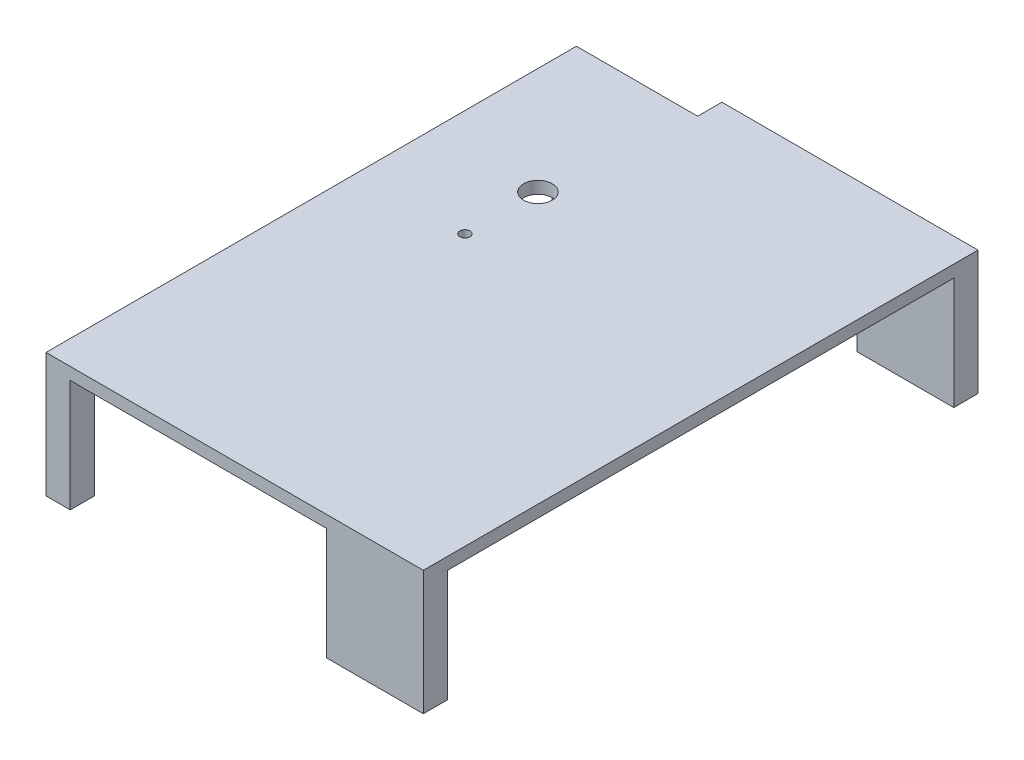
ISO-10303-21;
HEADER;
FILE_DESCRIPTION(('STEP AP214'),'2;1');
FILE_NAME('part.step','',(''),(''),'','','');
FILE_SCHEMA(('AUTOMOTIVE_DESIGN { 1 0 10303 214 1 1 1 1 }'));
ENDSEC;
DATA;
#1=APPLICATION_CONTEXT('core data for automotive mechanical design processes');
#2=APPLICATION_PROTOCOL_DEFINITION('international standard','automotive_design',2000,#1);
#3=PRODUCT_CONTEXT('',#1,'mechanical');
#4=PRODUCT('Part','Part','',(#3));
#5=PRODUCT_RELATED_PRODUCT_CATEGORY('part','',(#4));
#6=PRODUCT_DEFINITION_FORMATION('','',#4);
#7=PRODUCT_DEFINITION_CONTEXT('part definition',#1,'design');
#8=PRODUCT_DEFINITION('design','',#6,#7);
#9=PRODUCT_DEFINITION_SHAPE('','',#8);
#10=(LENGTH_UNIT() NAMED_UNIT(*) SI_UNIT(.MILLI.,.METRE.));
#11=(NAMED_UNIT(*) PLANE_ANGLE_UNIT() SI_UNIT($,.RADIAN.));
#12=(NAMED_UNIT(*) SI_UNIT($,.STERADIAN.) SOLID_ANGLE_UNIT());
#13=UNCERTAINTY_MEASURE_WITH_UNIT(LENGTH_MEASURE(1.E-05),#10,'distance_accuracy_value','');
#14=(GEOMETRIC_REPRESENTATION_CONTEXT(3) GLOBAL_UNCERTAINTY_ASSIGNED_CONTEXT((#13)) GLOBAL_UNIT_ASSIGNED_CONTEXT((#10,
#11,#12)) REPRESENTATION_CONTEXT('',''));
#15=CARTESIAN_POINT('',(0.,0.,0.));
#16=DIRECTION('',(0.,0.,1.));
#17=DIRECTION('',(1.,0.,0.));
#18=AXIS2_PLACEMENT_3D('',#15,#16,#17);
#19=CARTESIAN_POINT('',(12.7,0.,0.));
#20=DIRECTION('',(1.,0.,0.));
#21=DIRECTION('',(0.,0.,-1.));
#22=AXIS2_PLACEMENT_3D('',#19,#20,#21);
#23=PLANE('',#22);
#24=DIRECTION('',(0.,0.,-1.));
#25=VECTOR('',#24,1.);
#26=CARTESIAN_POINT('',(12.7,-58.7375,0.));
#27=LINE('',#26,#25);
#28=CARTESIAN_POINT('',(12.7,-58.7375,145.25625));
#29=VERTEX_POINT('',#28);
#30=CARTESIAN_POINT('',(12.7,-58.7375,132.55625));
#31=VERTEX_POINT('',#30);
#32=EDGE_CURVE('E301',#29,#31,#27,.T.);
#33=ORIENTED_EDGE('',*,*,#32,.F.);
#34=DIRECTION('',(0.,-1.,0.));
#35=VECTOR('',#34,1.);
#36=CARTESIAN_POINT('',(12.7,6.35,145.25625));
#37=LINE('',#36,#35);
#38=CARTESIAN_POINT('',(12.7,6.35,145.25625));
#39=VERTEX_POINT('',#38);
#40=EDGE_CURVE('E41',#39,#29,#37,.T.);
#41=ORIENTED_EDGE('',*,*,#40,.F.);
#42=DIRECTION('',(0.,0.,1.));
#43=VECTOR('',#42,1.);
#44=CARTESIAN_POINT('',(12.7,6.35,0.));
#45=LINE('',#44,#43);
#46=CARTESIAN_POINT('',(12.7,6.35,-132.55625));
#47=VERTEX_POINT('',#46);
#48=EDGE_CURVE('E49',#47,#39,#45,.T.);
#49=ORIENTED_EDGE('',*,*,#48,.F.);
#50=DIRECTION('',(0.,1.,0.));
#51=VECTOR('',#50,1.);
#52=CARTESIAN_POINT('',(12.7,-10.16,-132.55625));
#53=LINE('',#52,#51);
#54=CARTESIAN_POINT('',(12.7,-58.7375,-132.55625));
#55=VERTEX_POINT('',#54);
#56=EDGE_CURVE('E57',#55,#47,#53,.T.);
#57=ORIENTED_EDGE('',*,*,#56,.F.);
#58=DIRECTION('',(0.,0.,-1.));
#59=VECTOR('',#58,1.);
#60=CARTESIAN_POINT('',(12.7,-58.7375,0.));
#61=LINE('',#60,#59);
#62=CARTESIAN_POINT('',(12.7,-58.7375,-119.85625));
#63=VERTEX_POINT('',#62);
#64=EDGE_CURVE('E166',#63,#55,#61,.T.);
#65=ORIENTED_EDGE('',*,*,#64,.F.);
#66=DIRECTION('',(0.,-1.,0.));
#67=VECTOR('',#66,1.);
#68=CARTESIAN_POINT('',(12.7,-58.7375,-119.85625));
#69=LINE('',#68,#67);
#70=CARTESIAN_POINT('',(12.7,0.,-119.85625));
#71=VERTEX_POINT('',#70);
#72=EDGE_CURVE('E299',#71,#63,#69,.T.);
#73=ORIENTED_EDGE('',*,*,#72,.F.);
#74=DIRECTION('',(0.,0.,1.));
#75=VECTOR('',#74,1.);
#76=CARTESIAN_POINT('',(12.7,0.,0.));
#77=LINE('',#76,#75);
#78=CARTESIAN_POINT('',(12.7,0.,132.55625));
#79=VERTEX_POINT('',#78);
#80=EDGE_CURVE('E11',#71,#79,#77,.T.);
#81=ORIENTED_EDGE('',*,*,#80,.T.);
#82=DIRECTION('',(0.,1.,0.));
#83=VECTOR('',#82,1.);
#84=CARTESIAN_POINT('',(12.7,-58.7375,132.55625));
#85=LINE('',#84,#83);
#86=EDGE_CURVE('E36',#31,#79,#85,.T.);
#87=ORIENTED_EDGE('',*,*,#86,.F.);
#88=EDGE_LOOP('',(#33,#41,#49,#57,#65,#73,#81,#87));
#89=FACE_BOUND('',#88,.T.);
#90=ADVANCED_FACE('F33',(#89),#23,.F.);
#91=CARTESIAN_POINT('',(0.,-58.7375,0.));
#92=DIRECTION('',(0.,-1.,0.));
#93=DIRECTION('',(0.,0.,-1.));
#94=AXIS2_PLACEMENT_3D('',#91,#92,#93);
#95=PLANE('',#94);
#96=DIRECTION('',(0.,0.,1.));
#97=VECTOR('',#96,1.);
#98=CARTESIAN_POINT('',(210.34375,-58.7375,-145.25625));
#99=LINE('',#98,#97);
#100=CARTESIAN_POINT('',(210.34375,-58.7375,-145.25625));
#101=VERTEX_POINT('',#100);
#102=CARTESIAN_POINT('',(210.34375,-58.7375,-132.55625));
#103=VERTEX_POINT('',#102);
#104=EDGE_CURVE('E213',#101,#103,#99,.T.);
#105=ORIENTED_EDGE('',*,*,#104,.T.);
#106=DIRECTION('',(-1.,0.,0.));
#107=VECTOR('',#106,1.);
#108=CARTESIAN_POINT('',(210.34375,-58.7375,-132.55625));
#109=LINE('',#108,#107);
#110=CARTESIAN_POINT('',(159.54375,-58.7375,-132.55625));
#111=VERTEX_POINT('',#110);
#112=EDGE_CURVE('E216',#103,#111,#109,.T.);
#113=ORIENTED_EDGE('',*,*,#112,.T.);
#114=DIRECTION('',(0.,0.,-1.));
#115=VECTOR('',#114,1.);
#116=CARTESIAN_POINT('',(159.54375,-58.7375,-145.25625));
#117=LINE('',#116,#115);
#118=CARTESIAN_POINT('',(159.54375,-58.7375,-145.25625));
#119=VERTEX_POINT('',#118);
#120=EDGE_CURVE('E219',#111,#119,#117,.T.);
#121=ORIENTED_EDGE('',*,*,#120,.T.);
#122=DIRECTION('',(1.,0.,0.));
#123=VECTOR('',#122,1.);
#124=CARTESIAN_POINT('',(210.34375,-58.7375,-145.25625));
#125=LINE('',#124,#123);
#126=EDGE_CURVE('E221',#119,#101,#125,.T.);
#127=ORIENTED_EDGE('',*,*,#126,.T.);
#128=EDGE_LOOP('',(#105,#113,#121,#127));
#129=FACE_BOUND('',#128,.T.);
#130=ADVANCED_FACE('F349',(#129),#95,.T.);
#131=CARTESIAN_POINT('',(210.34375,-58.7375,132.55625));
#132=DIRECTION('',(0.,0.,1.));
#133=DIRECTION('',(1.,0.,0.));
#134=AXIS2_PLACEMENT_3D('',#131,#132,#133);
#135=PLANE('',#134);
#136=DIRECTION('',(1.,0.,0.));
#137=VECTOR('',#136,1.);
#138=CARTESIAN_POINT('',(210.34375,0.,132.55625));
#139=LINE('',#138,#137);
#140=CARTESIAN_POINT('',(159.54375,0.,132.55625));
#141=VERTEX_POINT('',#140);
#142=CARTESIAN_POINT('',(210.34375,0.,132.55625));
#143=VERTEX_POINT('',#142);
#144=EDGE_CURVE('E196',#141,#143,#139,.T.);
#145=ORIENTED_EDGE('',*,*,#144,.T.);
#146=DIRECTION('',(0.,1.,0.));
#147=VECTOR('',#146,1.);
#148=CARTESIAN_POINT('',(210.34375,-58.7375,132.55625));
#149=LINE('',#148,#147);
#150=CARTESIAN_POINT('',(210.34375,-58.7375,132.55625));
#151=VERTEX_POINT('',#150);
#152=EDGE_CURVE('E202',#151,#143,#149,.T.);
#153=ORIENTED_EDGE('',*,*,#152,.F.);
#154=DIRECTION('',(1.,0.,0.));
#155=VECTOR('',#154,1.);
#156=CARTESIAN_POINT('',(210.34375,-58.7375,132.55625));
#157=LINE('',#156,#155);
#158=CARTESIAN_POINT('',(159.54375,-58.7375,132.55625));
#159=VERTEX_POINT('',#158);
#160=EDGE_CURVE('E200',#159,#151,#157,.T.);
#161=ORIENTED_EDGE('',*,*,#160,.F.);
#162=DIRECTION('',(0.,1.,0.));
#163=VECTOR('',#162,1.);
#164=CARTESIAN_POINT('',(159.54375,-58.7375,132.55625));
#165=LINE('',#164,#163);
#166=EDGE_CURVE('E207',#159,#141,#165,.T.);
#167=ORIENTED_EDGE('',*,*,#166,.T.);
#168=EDGE_LOOP('',(#145,#153,#161,#167));
#169=FACE_BOUND('',#168,.T.);
#170=ADVANCED_FACE('F353',(#169),#135,.F.);
#171=CARTESIAN_POINT('',(210.34375,-58.7375,-132.55625));
#172=DIRECTION('',(0.,0.,-1.));
#173=DIRECTION('',(-1.,0.,0.));
#174=AXIS2_PLACEMENT_3D('',#171,#172,#173);
#175=PLANE('',#174);
#176=DIRECTION('',(-1.,0.,0.));
#177=VECTOR('',#176,1.);
#178=CARTESIAN_POINT('',(210.34375,0.,-132.55625));
#179=LINE('',#178,#177);
#180=CARTESIAN_POINT('',(210.34375,0.,-132.55625));
#181=VERTEX_POINT('',#180);
#182=CARTESIAN_POINT('',(159.54375,0.,-132.55625));
#183=VERTEX_POINT('',#182);
#184=EDGE_CURVE('E212',#181,#183,#179,.T.);
#185=ORIENTED_EDGE('',*,*,#184,.T.);
#186=DIRECTION('',(0.,1.,0.));
#187=VECTOR('',#186,1.);
#188=CARTESIAN_POINT('',(159.54375,-58.7375,-132.55625));
#189=LINE('',#188,#187);
#190=EDGE_CURVE('E229',#111,#183,#189,.T.);
#191=ORIENTED_EDGE('',*,*,#190,.F.);
#192=ORIENTED_EDGE('',*,*,#112,.F.);
#193=DIRECTION('',(0.,1.,0.));
#194=VECTOR('',#193,1.);
#195=CARTESIAN_POINT('',(210.34375,-58.7375,-132.55625));
#196=LINE('',#195,#194);
#197=EDGE_CURVE('E232',#103,#181,#196,.T.);
#198=ORIENTED_EDGE('',*,*,#197,.T.);
#199=EDGE_LOOP('',(#185,#191,#192,#198));
#200=FACE_BOUND('',#199,.T.);
#201=ADVANCED_FACE('F364',(#200),#175,.F.);
#202=CARTESIAN_POINT('',(159.54375,-58.7375,-145.25625));
#203=DIRECTION('',(1.,0.,0.));
#204=DIRECTION('',(0.,0.,-1.));
#205=AXIS2_PLACEMENT_3D('',#202,#203,#204);
#206=PLANE('',#205);
#207=DIRECTION('',(0.,0.,-1.));
#208=VECTOR('',#207,1.);
#209=CARTESIAN_POINT('',(159.54375,0.,-145.25625));
#210=LINE('',#209,#208);
#211=CARTESIAN_POINT('',(159.54375,0.,-145.25625));
#212=VERTEX_POINT('',#211);
#213=EDGE_CURVE('E217',#183,#212,#210,.T.);
#214=ORIENTED_EDGE('',*,*,#213,.T.);
#215=DIRECTION('',(0.,1.,0.));
#216=VECTOR('',#215,1.);
#217=CARTESIAN_POINT('',(159.54375,-58.7375,-145.25625));
#218=LINE('',#217,#216);
#219=EDGE_CURVE('E224',#119,#212,#218,.T.);
#220=ORIENTED_EDGE('',*,*,#219,.F.);
#221=ORIENTED_EDGE('',*,*,#120,.F.);
#222=ORIENTED_EDGE('',*,*,#190,.T.);
#223=EDGE_LOOP('',(#214,#220,#221,#222));
#224=FACE_BOUND('',#223,.T.);
#225=ADVANCED_FACE('F414',(#224),#206,.F.);
#226=CARTESIAN_POINT('',(0.,-58.7375,0.));
#227=DIRECTION('',(0.,1.,0.));
#228=DIRECTION('',(0.,0.,1.));
#229=AXIS2_PLACEMENT_3D('',#226,#227,#228);
#230=PLANE('',#229);
#231=DIRECTION('',(0.,0.,1.));
#232=VECTOR('',#231,1.);
#233=CARTESIAN_POINT('',(210.34375,-58.7375,145.25625));
#234=LINE('',#233,#232);
#235=CARTESIAN_POINT('',(210.34375,-58.7375,145.25625));
#236=VERTEX_POINT('',#235);
#237=EDGE_CURVE('E192',#151,#236,#234,.T.);
#238=ORIENTED_EDGE('',*,*,#237,.T.);
#239=DIRECTION('',(-1.,0.,0.));
#240=VECTOR('',#239,1.);
#241=CARTESIAN_POINT('',(210.34375,-58.7375,145.25625));
#242=LINE('',#241,#240);
#243=CARTESIAN_POINT('',(159.54375,-58.7375,145.25625));
#244=VERTEX_POINT('',#243);
#245=EDGE_CURVE('E195',#236,#244,#242,.T.);
#246=ORIENTED_EDGE('',*,*,#245,.T.);
#247=DIRECTION('',(0.,0.,-1.));
#248=VECTOR('',#247,1.);
#249=CARTESIAN_POINT('',(159.54375,-58.7375,145.25625));
#250=LINE('',#249,#248);
#251=EDGE_CURVE('E198',#244,#159,#250,.T.);
#252=ORIENTED_EDGE('',*,*,#251,.T.);
#253=ORIENTED_EDGE('',*,*,#160,.T.);
#254=EDGE_LOOP('',(#238,#246,#252,#253));
#255=FACE_BOUND('',#254,.T.);
#256=ADVANCED_FACE('F401',(#255),#230,.F.);
#257=CARTESIAN_POINT('',(159.54375,-58.7375,145.25625));
#258=DIRECTION('',(1.,0.,0.));
#259=DIRECTION('',(0.,0.,-1.));
#260=AXIS2_PLACEMENT_3D('',#257,#258,#259);
#261=PLANE('',#260);
#262=DIRECTION('',(0.,0.,-1.));
#263=VECTOR('',#262,1.);
#264=CARTESIAN_POINT('',(159.54375,0.,145.25625));
#265=LINE('',#264,#263);
#266=CARTESIAN_POINT('',(159.54375,0.,145.25625));
#267=VERTEX_POINT('',#266);
#268=EDGE_CURVE('E177',#267,#141,#265,.T.);
#269=ORIENTED_EDGE('',*,*,#268,.T.);
#270=ORIENTED_EDGE('',*,*,#166,.F.);
#271=ORIENTED_EDGE('',*,*,#251,.F.);
#272=DIRECTION('',(0.,1.,0.));
#273=VECTOR('',#272,1.);
#274=CARTESIAN_POINT('',(159.54375,-58.7375,145.25625));
#275=LINE('',#274,#273);
#276=EDGE_CURVE('E210',#244,#267,#275,.T.);
#277=ORIENTED_EDGE('',*,*,#276,.T.);
#278=EDGE_LOOP('',(#269,#270,#271,#277));
#279=FACE_BOUND('',#278,.T.);
#280=ADVANCED_FACE('F388',(#279),#261,.F.);
#281=CARTESIAN_POINT('',(-210.34375,6.35,-145.25625));
#282=DIRECTION('',(0.,0.,1.));
#283=DIRECTION('',(1.,0.,0.));
#284=AXIS2_PLACEMENT_3D('',#281,#282,#283);
#285=PLANE('',#284);
#286=DIRECTION('',(0.,-1.,0.));
#287=VECTOR('',#286,1.);
#288=CARTESIAN_POINT('',(210.34375,6.35,-145.25625));
#289=LINE('',#288,#287);
#290=CARTESIAN_POINT('',(210.34375,6.35,-145.25625));
#291=VERTEX_POINT('',#290);
#292=EDGE_CURVE('E289',#291,#101,#289,.T.);
#293=ORIENTED_EDGE('',*,*,#292,.T.);
#294=ORIENTED_EDGE('',*,*,#126,.F.);
#295=ORIENTED_EDGE('',*,*,#219,.T.);
#296=DIRECTION('',(-1.,0.,0.));
#297=VECTOR('',#296,1.);
#298=CARTESIAN_POINT('',(-210.34375,0.,-145.25625));
#299=LINE('',#298,#297);
#300=CARTESIAN_POINT('',(76.2,0.,-145.25625));
#301=VERTEX_POINT('',#300);
#302=EDGE_CURVE('E284',#212,#301,#299,.T.);
#303=ORIENTED_EDGE('',*,*,#302,.T.);
#304=DIRECTION('',(0.,1.,0.));
#305=VECTOR('',#304,1.);
#306=CARTESIAN_POINT('',(76.2,-10.16,-145.25625));
#307=LINE('',#306,#305);
#308=CARTESIAN_POINT('',(76.2,6.35,-145.25625));
#309=VERTEX_POINT('',#308);
#310=EDGE_CURVE('E266',#301,#309,#307,.T.);
#311=ORIENTED_EDGE('',*,*,#310,.T.);
#312=DIRECTION('',(-1.,0.,0.));
#313=VECTOR('',#312,1.);
#314=CARTESIAN_POINT('',(-210.34375,6.35,-145.25625));
#315=LINE('',#314,#313);
#316=EDGE_CURVE('E276',#291,#309,#315,.T.);
#317=ORIENTED_EDGE('',*,*,#316,.F.);
#318=EDGE_LOOP('',(#293,#294,#295,#303,#311,#317));
#319=FACE_BOUND('',#318,.T.);
#320=ADVANCED_FACE('F386',(#319),#285,.F.);
#321=CARTESIAN_POINT('',(210.34375,6.35,145.25625));
#322=DIRECTION('',(-1.,0.,0.));
#323=DIRECTION('',(0.,0.,1.));
#324=AXIS2_PLACEMENT_3D('',#321,#322,#323);
#325=PLANE('',#324);
#326=DIRECTION('',(0.,-1.,0.));
#327=VECTOR('',#326,1.);
#328=CARTESIAN_POINT('',(210.34375,6.35,145.25625));
#329=LINE('',#328,#327);
#330=CARTESIAN_POINT('',(210.34375,6.35,145.25625));
#331=VERTEX_POINT('',#330);
#332=EDGE_CURVE('E282',#331,#236,#329,.T.);
#333=ORIENTED_EDGE('',*,*,#332,.T.);
#334=ORIENTED_EDGE('',*,*,#237,.F.);
#335=ORIENTED_EDGE('',*,*,#152,.T.);
#336=DIRECTION('',(0.,0.,-1.));
#337=VECTOR('',#336,1.);
#338=CARTESIAN_POINT('',(210.34375,0.,145.25625));
#339=LINE('',#338,#337);
#340=EDGE_CURVE('E270',#143,#181,#339,.T.);
#341=ORIENTED_EDGE('',*,*,#340,.T.);
#342=ORIENTED_EDGE('',*,*,#197,.F.);
#343=ORIENTED_EDGE('',*,*,#104,.F.);
#344=ORIENTED_EDGE('',*,*,#292,.F.);
#345=DIRECTION('',(0.,0.,-1.));
#346=VECTOR('',#345,1.);
#347=CARTESIAN_POINT('',(210.34375,6.35,145.25625));
#348=LINE('',#347,#346);
#349=EDGE_CURVE('E273',#331,#291,#348,.T.);
#350=ORIENTED_EDGE('',*,*,#349,.F.);
#351=EDGE_LOOP('',(#333,#334,#335,#341,#342,#343,#344,#350));
#352=FACE_BOUND('',#351,.T.);
#353=ADVANCED_FACE('F376',(#352),#325,.F.);
#354=CARTESIAN_POINT('',(68.73875,-10.16,-56.35625));
#355=DIRECTION('',(0.,1.,0.));
#356=DIRECTION('',(0.,0.,1.));
#357=AXIS2_PLACEMENT_3D('',#354,#355,#356);
#358=CYLINDRICAL_SURFACE('',#357,7.493);
#359=CARTESIAN_POINT('',(68.73875,0.,-56.35625));
#360=DIRECTION('',(0.,-1.,0.));
#361=DIRECTION('',(0.,0.,-1.));
#362=AXIS2_PLACEMENT_3D('',#359,#360,#361);
#363=CIRCLE('',#362,7.493);
#364=CARTESIAN_POINT('',(68.73875,0.,-63.84925));
#365=VERTEX_POINT('',#364);
#366=EDGE_CURVE('E260',#365,#365,#363,.T.);
#367=ORIENTED_EDGE('',*,*,#366,.T.);
#368=EDGE_LOOP('',(#367));
#369=FACE_BOUND('',#368,.T.);
#370=CARTESIAN_POINT('',(68.73875,6.35,-56.35625));
#371=DIRECTION('',(0.,1.,0.));
#372=DIRECTION('',(0.,0.,1.));
#373=AXIS2_PLACEMENT_3D('',#370,#371,#372);
#374=CIRCLE('',#373,7.493);
#375=CARTESIAN_POINT('',(68.73875,6.35,-48.86325));
#376=VERTEX_POINT('',#375);
#377=EDGE_CURVE('E257',#376,#376,#374,.T.);
#378=ORIENTED_EDGE('',*,*,#377,.T.);
#379=EDGE_LOOP('',(#378));
#380=FACE_BOUND('',#379,.T.);
#381=ADVANCED_FACE('F373',(#369,#380),#358,.F.);
#382=CARTESIAN_POINT('',(68.61175,-10.16,-18.2562500000019));
#383=DIRECTION('',(0.,1.,0.));
#384=DIRECTION('',(0.,0.,1.));
#385=AXIS2_PLACEMENT_3D('',#382,#383,#384);
#386=CYLINDRICAL_SURFACE('',#385,2.667);
#387=CARTESIAN_POINT('',(68.61175,0.,-18.2562500000019));
#388=DIRECTION('',(0.,-1.,0.));
#389=DIRECTION('',(0.,0.,-1.));
#390=AXIS2_PLACEMENT_3D('',#387,#388,#389);
#391=CIRCLE('',#390,2.667);
#392=CARTESIAN_POINT('',(68.61175,0.,-20.9232500000019));
#393=VERTEX_POINT('',#392);
#394=EDGE_CURVE('E264',#393,#393,#391,.T.);
#395=ORIENTED_EDGE('',*,*,#394,.T.);
#396=EDGE_LOOP('',(#395));
#397=FACE_BOUND('',#396,.T.);
#398=CARTESIAN_POINT('',(68.61175,6.35,-18.2562500000019));
#399=DIRECTION('',(0.,1.,0.));
#400=DIRECTION('',(0.,0.,1.));
#401=AXIS2_PLACEMENT_3D('',#398,#399,#400);
#402=CIRCLE('',#401,2.667);
#403=CARTESIAN_POINT('',(68.61175,6.35,-15.5892500000019));
#404=VERTEX_POINT('',#403);
#405=EDGE_CURVE('E254',#404,#404,#402,.T.);
#406=ORIENTED_EDGE('',*,*,#405,.T.);
#407=EDGE_LOOP('',(#406));
#408=FACE_BOUND('',#407,.T.);
#409=ADVANCED_FACE('F370',(#397,#408),#386,.F.);
#410=CARTESIAN_POINT('',(76.2,-10.16,-132.55625));
#411=DIRECTION('',(1.,0.,0.));
#412=DIRECTION('',(0.,0.,-1.));
#413=AXIS2_PLACEMENT_3D('',#410,#411,#412);
#414=PLANE('',#413);
#415=DIRECTION('',(0.,0.,1.));
#416=VECTOR('',#415,1.);
#417=CARTESIAN_POINT('',(76.2,0.,0.));
#418=LINE('',#417,#416);
#419=CARTESIAN_POINT('',(76.2,0.,-132.55625));
#420=VERTEX_POINT('',#419);
#421=EDGE_CURVE('E292',#301,#420,#418,.T.);
#422=ORIENTED_EDGE('',*,*,#421,.T.);
#423=DIRECTION('',(0.,1.,0.));
#424=VECTOR('',#423,1.);
#425=CARTESIAN_POINT('',(76.2,-10.16,-132.55625));
#426=LINE('',#425,#424);
#427=CARTESIAN_POINT('',(76.2,6.35,-132.55625));
#428=VERTEX_POINT('',#427);
#429=EDGE_CURVE('E267',#420,#428,#426,.T.);
#430=ORIENTED_EDGE('',*,*,#429,.T.);
#431=DIRECTION('',(0.,0.,-1.));
#432=VECTOR('',#431,1.);
#433=CARTESIAN_POINT('',(76.2,6.35,-132.55625));
#434=LINE('',#433,#432);
#435=EDGE_CURVE('E261',#428,#309,#434,.T.);
#436=ORIENTED_EDGE('',*,*,#435,.T.);
#437=ORIENTED_EDGE('',*,*,#310,.F.);
#438=EDGE_LOOP('',(#422,#430,#436,#437));
#439=FACE_BOUND('',#438,.T.);
#440=ADVANCED_FACE('F332',(#439),#414,.F.);
#441=CARTESIAN_POINT('',(0.,6.35,0.));
#442=DIRECTION('',(0.,-1.,0.));
#443=DIRECTION('',(0.,0.,-1.));
#444=AXIS2_PLACEMENT_3D('',#441,#442,#443);
#445=PLANE('',#444);
#446=ORIENTED_EDGE('',*,*,#405,.F.);
#447=EDGE_LOOP('',(#446));
#448=FACE_BOUND('',#447,.T.);
#449=ORIENTED_EDGE('',*,*,#377,.F.);
#450=EDGE_LOOP('',(#449));
#451=FACE_BOUND('',#450,.T.);
#452=DIRECTION('',(1.,0.,0.));
#453=VECTOR('',#452,1.);
#454=CARTESIAN_POINT('',(-76.2,6.35,-132.55625));
#455=LINE('',#454,#453);
#456=EDGE_CURVE('E263',#47,#428,#455,.T.);
#457=ORIENTED_EDGE('',*,*,#456,.F.);
#458=ORIENTED_EDGE('',*,*,#48,.T.);
#459=DIRECTION('',(1.,0.,0.));
#460=VECTOR('',#459,1.);
#461=CARTESIAN_POINT('',(-210.34375,6.35,145.25625));
#462=LINE('',#461,#460);
#463=EDGE_CURVE('E280',#39,#331,#462,.T.);
#464=ORIENTED_EDGE('',*,*,#463,.T.);
#465=ORIENTED_EDGE('',*,*,#349,.T.);
#466=ORIENTED_EDGE('',*,*,#316,.T.);
#467=ORIENTED_EDGE('',*,*,#435,.F.);
#468=EDGE_LOOP('',(#457,#458,#464,#465,#466,#467));
#469=FACE_BOUND('',#468,.T.);
#470=ADVANCED_FACE('F330',(#448,#451,#469),#445,.F.);
#471=CARTESIAN_POINT('',(0.,0.,0.));
#472=DIRECTION('',(0.,-1.,0.));
#473=DIRECTION('',(0.,0.,-1.));
#474=AXIS2_PLACEMENT_3D('',#471,#472,#473);
#475=PLANE('',#474);
#476=ORIENTED_EDGE('',*,*,#80,.F.);
#477=DIRECTION('',(-1.,0.,0.));
#478=VECTOR('',#477,1.);
#479=CARTESIAN_POINT('',(-25.4,0.,-119.85625));
#480=LINE('',#479,#478);
#481=CARTESIAN_POINT('',(25.4,0.,-119.85625));
#482=VERTEX_POINT('',#481);
#483=EDGE_CURVE('E167',#482,#71,#480,.T.);
#484=ORIENTED_EDGE('',*,*,#483,.F.);
#485=DIRECTION('',(0.,0.,1.));
#486=VECTOR('',#485,1.);
#487=CARTESIAN_POINT('',(25.4,0.,-132.55625));
#488=LINE('',#487,#486);
#489=CARTESIAN_POINT('',(25.4,0.,-132.55625));
#490=VERTEX_POINT('',#489);
#491=EDGE_CURVE('E187',#490,#482,#488,.T.);
#492=ORIENTED_EDGE('',*,*,#491,.F.);
#493=DIRECTION('',(-1.,0.,0.));
#494=VECTOR('',#493,1.);
#495=CARTESIAN_POINT('',(0.,0.,-132.55625));
#496=LINE('',#495,#494);
#497=EDGE_CURVE('E174',#420,#490,#496,.T.);
#498=ORIENTED_EDGE('',*,*,#497,.F.);
#499=ORIENTED_EDGE('',*,*,#421,.F.);
#500=ORIENTED_EDGE('',*,*,#302,.F.);
#501=ORIENTED_EDGE('',*,*,#213,.F.);
#502=ORIENTED_EDGE('',*,*,#184,.F.);
#503=ORIENTED_EDGE('',*,*,#340,.F.);
#504=ORIENTED_EDGE('',*,*,#144,.F.);
#505=ORIENTED_EDGE('',*,*,#268,.F.);
#506=DIRECTION('',(1.,0.,0.));
#507=VECTOR('',#506,1.);
#508=CARTESIAN_POINT('',(-210.34375,0.,145.25625));
#509=LINE('',#508,#507);
#510=CARTESIAN_POINT('',(25.4,0.,145.25625));
#511=VERTEX_POINT('',#510);
#512=EDGE_CURVE('E277',#511,#267,#509,.T.);
#513=ORIENTED_EDGE('',*,*,#512,.F.);
#514=DIRECTION('',(0.,0.,1.));
#515=VECTOR('',#514,1.);
#516=CARTESIAN_POINT('',(25.4,0.,132.55625));
#517=LINE('',#516,#515);
#518=CARTESIAN_POINT('',(25.4,0.,132.55625));
#519=VERTEX_POINT('',#518);
#520=EDGE_CURVE('E235',#519,#511,#517,.T.);
#521=ORIENTED_EDGE('',*,*,#520,.F.);
#522=DIRECTION('',(1.,0.,0.));
#523=VECTOR('',#522,1.);
#524=CARTESIAN_POINT('',(-25.4,0.,132.55625));
#525=LINE('',#524,#523);
#526=EDGE_CURVE('E240',#79,#519,#525,.T.);
#527=ORIENTED_EDGE('',*,*,#526,.F.);
#528=EDGE_LOOP('',(#476,#484,#492,#498,#499,#500,#501,#502,#503,#504,#505,#513,#521,#527));
#529=FACE_BOUND('',#528,.T.);
#530=ORIENTED_EDGE('',*,*,#394,.F.);
#531=EDGE_LOOP('',(#530));
#532=FACE_BOUND('',#531,.T.);
#533=ORIENTED_EDGE('',*,*,#366,.F.);
#534=EDGE_LOOP('',(#533));
#535=FACE_BOUND('',#534,.T.);
#536=ADVANCED_FACE('F317',(#529,#532,#535),#475,.T.);
#537=CARTESIAN_POINT('',(25.4,-58.7375,-132.55625));
#538=DIRECTION('',(-1.,0.,0.));
#539=DIRECTION('',(0.,0.,1.));
#540=AXIS2_PLACEMENT_3D('',#537,#538,#539);
#541=PLANE('',#540);
#542=ORIENTED_EDGE('',*,*,#491,.T.);
#543=DIRECTION('',(0.,1.,0.));
#544=VECTOR('',#543,1.);
#545=CARTESIAN_POINT('',(25.4,-58.7375,-119.85625));
#546=LINE('',#545,#544);
#547=CARTESIAN_POINT('',(25.4,-58.7375,-119.85625));
#548=VERTEX_POINT('',#547);
#549=EDGE_CURVE('E178',#548,#482,#546,.T.);
#550=ORIENTED_EDGE('',*,*,#549,.F.);
#551=DIRECTION('',(0.,0.,1.));
#552=VECTOR('',#551,1.);
#553=CARTESIAN_POINT('',(25.4,-58.7375,-132.55625));
#554=LINE('',#553,#552);
#555=CARTESIAN_POINT('',(25.4,-58.7375,-132.55625));
#556=VERTEX_POINT('',#555);
#557=EDGE_CURVE('E163',#556,#548,#554,.T.);
#558=ORIENTED_EDGE('',*,*,#557,.F.);
#559=DIRECTION('',(0.,1.,0.));
#560=VECTOR('',#559,1.);
#561=CARTESIAN_POINT('',(25.4,-58.7375,-132.55625));
#562=LINE('',#561,#560);
#563=EDGE_CURVE('E170',#556,#490,#562,.T.);
#564=ORIENTED_EDGE('',*,*,#563,.T.);
#565=EDGE_LOOP('',(#542,#550,#558,#564));
#566=FACE_BOUND('',#565,.T.);
#567=ADVANCED_FACE('F180',(#566),#541,.F.);
#568=CARTESIAN_POINT('',(-76.2,-10.16,-132.55625));
#569=DIRECTION('',(0.,0.,1.));
#570=DIRECTION('',(1.,0.,0.));
#571=AXIS2_PLACEMENT_3D('',#568,#569,#570);
#572=PLANE('',#571);
#573=DIRECTION('',(1.,0.,0.));
#574=VECTOR('',#573,1.);
#575=CARTESIAN_POINT('',(-25.4,-58.7375,-132.55625));
#576=LINE('',#575,#574);
#577=EDGE_CURVE('E158',#55,#556,#576,.T.);
#578=ORIENTED_EDGE('',*,*,#577,.F.);
#579=ORIENTED_EDGE('',*,*,#56,.T.);
#580=ORIENTED_EDGE('',*,*,#456,.T.);
#581=ORIENTED_EDGE('',*,*,#429,.F.);
#582=ORIENTED_EDGE('',*,*,#497,.T.);
#583=ORIENTED_EDGE('',*,*,#563,.F.);
#584=EDGE_LOOP('',(#578,#579,#580,#581,#582,#583));
#585=FACE_BOUND('',#584,.T.);
#586=ADVANCED_FACE('F171',(#585),#572,.F.);
#587=CARTESIAN_POINT('',(-25.4,-58.7375,-119.85625));
#588=DIRECTION('',(0.,0.,-1.));
#589=DIRECTION('',(-1.,0.,0.));
#590=AXIS2_PLACEMENT_3D('',#587,#588,#589);
#591=PLANE('',#590);
#592=ORIENTED_EDGE('',*,*,#483,.T.);
#593=ORIENTED_EDGE('',*,*,#72,.T.);
#594=DIRECTION('',(-1.,0.,0.));
#595=VECTOR('',#594,1.);
#596=CARTESIAN_POINT('',(-25.4,-58.7375,-119.85625));
#597=LINE('',#596,#595);
#598=EDGE_CURVE('E183',#548,#63,#597,.T.);
#599=ORIENTED_EDGE('',*,*,#598,.F.);
#600=ORIENTED_EDGE('',*,*,#549,.T.);
#601=EDGE_LOOP('',(#592,#593,#599,#600));
#602=FACE_BOUND('',#601,.T.);
#603=ADVANCED_FACE('F338',(#602),#591,.F.);
#604=CARTESIAN_POINT('',(0.,-58.7375,0.));
#605=DIRECTION('',(0.,1.,0.));
#606=DIRECTION('',(0.,0.,1.));
#607=AXIS2_PLACEMENT_3D('',#604,#605,#606);
#608=PLANE('',#607);
#609=ORIENTED_EDGE('',*,*,#598,.T.);
#610=ORIENTED_EDGE('',*,*,#64,.T.);
#611=ORIENTED_EDGE('',*,*,#577,.T.);
#612=ORIENTED_EDGE('',*,*,#557,.T.);
#613=EDGE_LOOP('',(#609,#610,#611,#612));
#614=FACE_BOUND('',#613,.T.);
#615=ADVANCED_FACE('F161',(#614),#608,.F.);
#616=CARTESIAN_POINT('',(25.4,-58.7375,132.55625));
#617=DIRECTION('',(-1.,0.,0.));
#618=DIRECTION('',(0.,0.,1.));
#619=AXIS2_PLACEMENT_3D('',#616,#617,#618);
#620=PLANE('',#619);
#621=ORIENTED_EDGE('',*,*,#520,.T.);
#622=DIRECTION('',(0.,1.,0.));
#623=VECTOR('',#622,1.);
#624=CARTESIAN_POINT('',(25.4,-58.7375,145.25625));
#625=LINE('',#624,#623);
#626=CARTESIAN_POINT('',(25.4,-58.7375,145.25625));
#627=VERTEX_POINT('',#626);
#628=EDGE_CURVE('E251',#627,#511,#625,.T.);
#629=ORIENTED_EDGE('',*,*,#628,.F.);
#630=DIRECTION('',(0.,0.,1.));
#631=VECTOR('',#630,1.);
#632=CARTESIAN_POINT('',(25.4,-58.7375,132.55625));
#633=LINE('',#632,#631);
#634=CARTESIAN_POINT('',(25.4,-58.7375,132.55625));
#635=VERTEX_POINT('',#634);
#636=EDGE_CURVE('E236',#635,#627,#633,.T.);
#637=ORIENTED_EDGE('',*,*,#636,.F.);
#638=DIRECTION('',(0.,1.,0.));
#639=VECTOR('',#638,1.);
#640=CARTESIAN_POINT('',(25.4,-58.7375,132.55625));
#641=LINE('',#640,#639);
#642=EDGE_CURVE('E245',#635,#519,#641,.T.);
#643=ORIENTED_EDGE('',*,*,#642,.T.);
#644=EDGE_LOOP('',(#621,#629,#637,#643));
#645=FACE_BOUND('',#644,.T.);
#646=ADVANCED_FACE('F323',(#645),#620,.F.);
#647=CARTESIAN_POINT('',(-25.4,-58.7375,132.55625));
#648=DIRECTION('',(0.,0.,1.));
#649=DIRECTION('',(1.,0.,0.));
#650=AXIS2_PLACEMENT_3D('',#647,#648,#649);
#651=PLANE('',#650);
#652=DIRECTION('',(1.,0.,0.));
#653=VECTOR('',#652,1.);
#654=CARTESIAN_POINT('',(-25.4,-58.7375,132.55625));
#655=LINE('',#654,#653);
#656=EDGE_CURVE('E243',#31,#635,#655,.T.);
#657=ORIENTED_EDGE('',*,*,#656,.F.);
#658=ORIENTED_EDGE('',*,*,#86,.T.);
#659=ORIENTED_EDGE('',*,*,#526,.T.);
#660=ORIENTED_EDGE('',*,*,#642,.F.);
#661=EDGE_LOOP('',(#657,#658,#659,#660));
#662=FACE_BOUND('',#661,.T.);
#663=ADVANCED_FACE('F309',(#662),#651,.F.);
#664=CARTESIAN_POINT('',(-210.34375,6.35,145.25625));
#665=DIRECTION('',(0.,0.,-1.));
#666=DIRECTION('',(-1.,0.,0.));
#667=AXIS2_PLACEMENT_3D('',#664,#665,#666);
#668=PLANE('',#667);
#669=ORIENTED_EDGE('',*,*,#463,.F.);
#670=ORIENTED_EDGE('',*,*,#40,.T.);
#671=DIRECTION('',(-1.,0.,0.));
#672=VECTOR('',#671,1.);
#673=CARTESIAN_POINT('',(-25.4,-58.7375,145.25625));
#674=LINE('',#673,#672);
#675=EDGE_CURVE('E239',#627,#29,#674,.T.);
#676=ORIENTED_EDGE('',*,*,#675,.F.);
#677=ORIENTED_EDGE('',*,*,#628,.T.);
#678=ORIENTED_EDGE('',*,*,#512,.T.);
#679=ORIENTED_EDGE('',*,*,#276,.F.);
#680=ORIENTED_EDGE('',*,*,#245,.F.);
#681=ORIENTED_EDGE('',*,*,#332,.F.);
#682=EDGE_LOOP('',(#669,#670,#676,#677,#678,#679,#680,#681));
#683=FACE_BOUND('',#682,.T.);
#684=ADVANCED_FACE('F327',(#683),#668,.F.);
#685=CARTESIAN_POINT('',(0.,-58.7375,0.));
#686=DIRECTION('',(0.,1.,0.));
#687=DIRECTION('',(0.,0.,1.));
#688=AXIS2_PLACEMENT_3D('',#685,#686,#687);
#689=PLANE('',#688);
#690=ORIENTED_EDGE('',*,*,#675,.T.);
#691=ORIENTED_EDGE('',*,*,#32,.T.);
#692=ORIENTED_EDGE('',*,*,#656,.T.);
#693=ORIENTED_EDGE('',*,*,#636,.T.);
#694=EDGE_LOOP('',(#690,#691,#692,#693));
#695=FACE_BOUND('',#694,.T.);
#696=ADVANCED_FACE('F324',(#695),#689,.F.);
#697=CLOSED_SHELL('',(#90,#130,#170,#201,#225,#256,#280,#320,#353,#381,#409,#440,#470,#536,#567,
#586,#603,#615,#646,#663,#684,#696));
#698=MANIFOLD_SOLID_BREP('B2',#697);
#699=ADVANCED_BREP_SHAPE_REPRESENTATION('',(#18,#698),#14);
#700=SHAPE_DEFINITION_REPRESENTATION(#9,#699);
ENDSEC;
END-ISO-10303-21;
